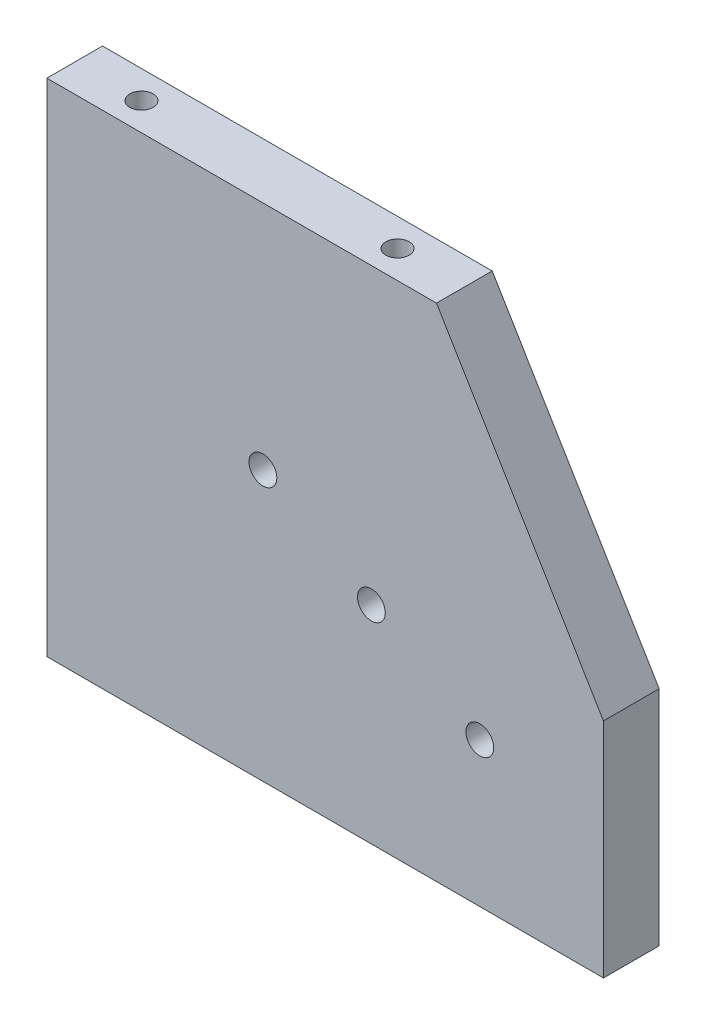
ISO-10303-21;
HEADER;
FILE_DESCRIPTION(('STEP AP214'),'2;1');
FILE_NAME('part.step','',(''),(''),'','','');
FILE_SCHEMA(('AUTOMOTIVE_DESIGN { 1 0 10303 214 1 1 1 1 }'));
ENDSEC;
DATA;
#1=APPLICATION_CONTEXT('core data for automotive mechanical design processes');
#2=APPLICATION_PROTOCOL_DEFINITION('international standard','automotive_design',2000,#1);
#3=PRODUCT_CONTEXT('',#1,'mechanical');
#4=PRODUCT('Part','Part','',(#3));
#5=PRODUCT_RELATED_PRODUCT_CATEGORY('part','',(#4));
#6=PRODUCT_DEFINITION_FORMATION('','',#4);
#7=PRODUCT_DEFINITION_CONTEXT('part definition',#1,'design');
#8=PRODUCT_DEFINITION('design','',#6,#7);
#9=PRODUCT_DEFINITION_SHAPE('','',#8);
#10=(LENGTH_UNIT() NAMED_UNIT(*) SI_UNIT(.MILLI.,.METRE.));
#11=(NAMED_UNIT(*) PLANE_ANGLE_UNIT() SI_UNIT($,.RADIAN.));
#12=(NAMED_UNIT(*) SI_UNIT($,.STERADIAN.) SOLID_ANGLE_UNIT());
#13=UNCERTAINTY_MEASURE_WITH_UNIT(LENGTH_MEASURE(1.E-05),#10,'distance_accuracy_value','');
#14=(GEOMETRIC_REPRESENTATION_CONTEXT(3) GLOBAL_UNCERTAINTY_ASSIGNED_CONTEXT((#13)) GLOBAL_UNIT_ASSIGNED_CONTEXT((#10,
#11,#12)) REPRESENTATION_CONTEXT('',''));
#15=CARTESIAN_POINT('',(0.,0.,0.));
#16=DIRECTION('',(0.,0.,1.));
#17=DIRECTION('',(1.,0.,0.));
#18=AXIS2_PLACEMENT_3D('',#15,#16,#17);
#19=CARTESIAN_POINT('',(-30.3157894736842,32.6842105263158,10.));
#20=DIRECTION('',(1.,0.,0.));
#21=DIRECTION('',(0.,0.,-1.));
#22=AXIS2_PLACEMENT_3D('',#19,#20,#21);
#23=PLANE('',#22);
#24=DIRECTION('',(0.,-1.,0.));
#25=VECTOR('',#24,1.);
#26=CARTESIAN_POINT('',(-30.3157894736842,32.6842105263158,0.));
#27=LINE('',#26,#25);
#28=CARTESIAN_POINT('',(-30.3157894736842,32.6842105263158,0.));
#29=VERTEX_POINT('',#28);
#30=CARTESIAN_POINT('',(-30.3157894736842,-57.3157894736842,0.));
#31=VERTEX_POINT('',#30);
#32=EDGE_CURVE('E113',#29,#31,#27,.T.);
#33=ORIENTED_EDGE('',*,*,#32,.T.);
#34=DIRECTION('',(0.,0.,-1.));
#35=VECTOR('',#34,1.);
#36=CARTESIAN_POINT('',(-30.3157894736842,-57.3157894736842,10.));
#37=LINE('',#36,#35);
#38=CARTESIAN_POINT('',(-30.3157894736842,-57.3157894736842,10.));
#39=VERTEX_POINT('',#38);
#40=EDGE_CURVE('E11',#39,#31,#37,.T.);
#41=ORIENTED_EDGE('',*,*,#40,.F.);
#42=DIRECTION('',(0.,-1.,0.));
#43=VECTOR('',#42,1.);
#44=CARTESIAN_POINT('',(-30.3157894736842,32.6842105263158,10.));
#45=LINE('',#44,#43);
#46=CARTESIAN_POINT('',(-30.3157894736842,32.6842105263158,10.));
#47=VERTEX_POINT('',#46);
#48=EDGE_CURVE('E121',#47,#39,#45,.T.);
#49=ORIENTED_EDGE('',*,*,#48,.F.);
#50=DIRECTION('',(0.,0.,-1.));
#51=VECTOR('',#50,1.);
#52=CARTESIAN_POINT('',(-30.3157894736842,32.6842105263158,10.));
#53=LINE('',#52,#51);
#54=EDGE_CURVE('E109',#47,#29,#53,.T.);
#55=ORIENTED_EDGE('',*,*,#54,.T.);
#56=EDGE_LOOP('',(#33,#41,#49,#55));
#57=FACE_BOUND('',#56,.T.);
#58=ADVANCED_FACE('F35',(#57),#23,.F.);
#59=CARTESIAN_POINT('',(-30.3157894736842,-57.3157894736842,10.));
#60=DIRECTION('',(0.,1.,0.));
#61=DIRECTION('',(0.,0.,1.));
#62=AXIS2_PLACEMENT_3D('',#59,#60,#61);
#63=PLANE('',#62);
#64=DIRECTION('',(1.,0.,0.));
#65=VECTOR('',#64,1.);
#66=CARTESIAN_POINT('',(-30.3157894736842,-57.3157894736842,0.));
#67=LINE('',#66,#65);
#68=CARTESIAN_POINT('',(69.6842105263158,-57.3157894736842,0.));
#69=VERTEX_POINT('',#68);
#70=EDGE_CURVE('E116',#31,#69,#67,.T.);
#71=ORIENTED_EDGE('',*,*,#70,.T.);
#72=DIRECTION('',(0.,0.,-1.));
#73=VECTOR('',#72,1.);
#74=CARTESIAN_POINT('',(69.6842105263158,-57.3157894736842,10.));
#75=LINE('',#74,#73);
#76=CARTESIAN_POINT('',(69.6842105263158,-57.3157894736842,10.));
#77=VERTEX_POINT('',#76);
#78=EDGE_CURVE('E44',#77,#69,#75,.T.);
#79=ORIENTED_EDGE('',*,*,#78,.F.);
#80=DIRECTION('',(1.,0.,0.));
#81=VECTOR('',#80,1.);
#82=CARTESIAN_POINT('',(-30.3157894736842,-57.3157894736842,10.));
#83=LINE('',#82,#81);
#84=EDGE_CURVE('E87',#39,#77,#83,.T.);
#85=ORIENTED_EDGE('',*,*,#84,.F.);
#86=ORIENTED_EDGE('',*,*,#40,.T.);
#87=EDGE_LOOP('',(#71,#79,#85,#86));
#88=FACE_BOUND('',#87,.T.);
#89=ADVANCED_FACE('F145',(#88),#63,.F.);
#90=CARTESIAN_POINT('',(69.6842105263158,-17.3157894736842,10.));
#91=DIRECTION('',(-1.,0.,0.));
#92=DIRECTION('',(0.,0.,1.));
#93=AXIS2_PLACEMENT_3D('',#90,#91,#92);
#94=PLANE('',#93);
#95=DIRECTION('',(0.,1.,0.));
#96=VECTOR('',#95,1.);
#97=CARTESIAN_POINT('',(69.6842105263158,-17.3157894736842,0.));
#98=LINE('',#97,#96);
#99=CARTESIAN_POINT('',(69.6842105263158,-17.3157894736842,0.));
#100=VERTEX_POINT('',#99);
#101=EDGE_CURVE('E104',#69,#100,#98,.T.);
#102=ORIENTED_EDGE('',*,*,#101,.T.);
#103=DIRECTION('',(0.,0.,-1.));
#104=VECTOR('',#103,1.);
#105=CARTESIAN_POINT('',(69.6842105263158,-17.3157894736842,10.));
#106=LINE('',#105,#104);
#107=CARTESIAN_POINT('',(69.6842105263158,-17.3157894736842,10.));
#108=VERTEX_POINT('',#107);
#109=EDGE_CURVE('E101',#108,#100,#106,.T.);
#110=ORIENTED_EDGE('',*,*,#109,.F.);
#111=DIRECTION('',(0.,1.,0.));
#112=VECTOR('',#111,1.);
#113=CARTESIAN_POINT('',(69.6842105263158,-17.3157894736842,10.));
#114=LINE('',#113,#112);
#115=EDGE_CURVE('E93',#77,#108,#114,.T.);
#116=ORIENTED_EDGE('',*,*,#115,.F.);
#117=ORIENTED_EDGE('',*,*,#78,.T.);
#118=EDGE_LOOP('',(#102,#110,#116,#117));
#119=FACE_BOUND('',#118,.T.);
#120=ADVANCED_FACE('F102',(#119),#94,.F.);
#121=CARTESIAN_POINT('',(39.6842105263158,32.6842105263158,10.));
#122=DIRECTION('',(-0.857492925712544,-0.514495755427527,0.));
#123=DIRECTION('',(0.514495755427527,-0.857492925712544,0.));
#124=AXIS2_PLACEMENT_3D('',#121,#122,#123);
#125=PLANE('',#124);
#126=DIRECTION('',(-0.514495755427527,0.857492925712544,0.));
#127=VECTOR('',#126,1.);
#128=CARTESIAN_POINT('',(39.6842105263158,32.6842105263158,0.));
#129=LINE('',#128,#127);
#130=CARTESIAN_POINT('',(39.6842105263158,32.6842105263158,0.));
#131=VERTEX_POINT('',#130);
#132=EDGE_CURVE('E73',#100,#131,#129,.T.);
#133=ORIENTED_EDGE('',*,*,#132,.T.);
#134=DIRECTION('',(0.,0.,-1.));
#135=VECTOR('',#134,1.);
#136=CARTESIAN_POINT('',(39.6842105263158,32.6842105263158,10.));
#137=LINE('',#136,#135);
#138=CARTESIAN_POINT('',(39.6842105263158,32.6842105263158,10.));
#139=VERTEX_POINT('',#138);
#140=EDGE_CURVE('E105',#139,#131,#137,.T.);
#141=ORIENTED_EDGE('',*,*,#140,.F.);
#142=DIRECTION('',(-0.514495755427527,0.857492925712544,0.));
#143=VECTOR('',#142,1.);
#144=CARTESIAN_POINT('',(39.6842105263158,32.6842105263158,10.));
#145=LINE('',#144,#143);
#146=EDGE_CURVE('E97',#108,#139,#145,.T.);
#147=ORIENTED_EDGE('',*,*,#146,.F.);
#148=ORIENTED_EDGE('',*,*,#109,.T.);
#149=EDGE_LOOP('',(#133,#141,#147,#148));
#150=FACE_BOUND('',#149,.T.);
#151=ADVANCED_FACE('F107',(#150),#125,.F.);
#152=CARTESIAN_POINT('',(-30.3157894736842,32.6842105263158,10.));
#153=DIRECTION('',(0.,-1.,0.));
#154=DIRECTION('',(1.,0.,0.));
#155=AXIS2_PLACEMENT_3D('',#152,#153,#154);
#156=PLANE('',#155);
#157=CARTESIAN_POINT('',(-18.3157894736842,32.6842105263158,5.));
#158=DIRECTION('',(0.,1.,0.));
#159=DIRECTION('',(0.,0.,1.));
#160=AXIS2_PLACEMENT_3D('',#157,#158,#159);
#161=CIRCLE('',#160,2.1);
#162=CARTESIAN_POINT('',(-18.3157894736842,32.6842105263158,7.1));
#163=VERTEX_POINT('',#162);
#164=EDGE_CURVE('E262',#163,#163,#161,.T.);
#165=ORIENTED_EDGE('',*,*,#164,.F.);
#166=EDGE_LOOP('',(#165));
#167=FACE_BOUND('',#166,.T.);
#168=CARTESIAN_POINT('',(27.6842105263158,32.6842105263158,5.));
#169=DIRECTION('',(0.,1.,0.));
#170=DIRECTION('',(0.,0.,1.));
#171=AXIS2_PLACEMENT_3D('',#168,#169,#170);
#172=CIRCLE('',#171,2.1);
#173=CARTESIAN_POINT('',(27.6842105263158,32.6842105263158,7.1));
#174=VERTEX_POINT('',#173);
#175=EDGE_CURVE('E264',#174,#174,#172,.T.);
#176=ORIENTED_EDGE('',*,*,#175,.F.);
#177=EDGE_LOOP('',(#176));
#178=FACE_BOUND('',#177,.T.);
#179=DIRECTION('',(-1.,0.,0.));
#180=VECTOR('',#179,1.);
#181=CARTESIAN_POINT('',(-30.3157894736842,32.6842105263158,0.));
#182=LINE('',#181,#180);
#183=EDGE_CURVE('E79',#131,#29,#182,.T.);
#184=ORIENTED_EDGE('',*,*,#183,.T.);
#185=ORIENTED_EDGE('',*,*,#54,.F.);
#186=DIRECTION('',(-1.,0.,0.));
#187=VECTOR('',#186,1.);
#188=CARTESIAN_POINT('',(-30.3157894736842,32.6842105263158,10.));
#189=LINE('',#188,#187);
#190=EDGE_CURVE('E52',#139,#47,#189,.T.);
#191=ORIENTED_EDGE('',*,*,#190,.F.);
#192=ORIENTED_EDGE('',*,*,#140,.T.);
#193=EDGE_LOOP('',(#184,#185,#191,#192));
#194=FACE_BOUND('',#193,.T.);
#195=ADVANCED_FACE('F130',(#167,#178,#194),#156,.F.);
#196=CARTESIAN_POINT('',(0.,0.,10.));
#197=DIRECTION('',(0.,0.,1.));
#198=DIRECTION('',(1.,0.,0.));
#199=AXIS2_PLACEMENT_3D('',#196,#197,#198);
#200=PLANE('',#199);
#201=CARTESIAN_POINT('',(8.49863894116592,-8.86578947368418,10.));
#202=DIRECTION('',(0.,0.,1.));
#203=DIRECTION('',(1.,0.,0.));
#204=AXIS2_PLACEMENT_3D('',#201,#202,#203);
#205=CIRCLE('',#204,2.5);
#206=CARTESIAN_POINT('',(10.9986389411659,-8.86578947368418,10.));
#207=VERTEX_POINT('',#206);
#208=EDGE_CURVE('E272',#207,#207,#205,.T.);
#209=ORIENTED_EDGE('',*,*,#208,.F.);
#210=EDGE_LOOP('',(#209));
#211=FACE_BOUND('',#210,.T.);
#212=CARTESIAN_POINT('',(47.4697821114657,-31.3657894736842,10.));
#213=DIRECTION('',(0.,0.,1.));
#214=DIRECTION('',(1.,0.,0.));
#215=AXIS2_PLACEMENT_3D('',#212,#213,#214);
#216=CIRCLE('',#215,2.5);
#217=CARTESIAN_POINT('',(49.9697821114657,-31.3657894736842,10.));
#218=VERTEX_POINT('',#217);
#219=EDGE_CURVE('E278',#218,#218,#216,.T.);
#220=ORIENTED_EDGE('',*,*,#219,.F.);
#221=EDGE_LOOP('',(#220));
#222=FACE_BOUND('',#221,.T.);
#223=CARTESIAN_POINT('',(27.9842105263158,-20.1157894736842,10.));
#224=DIRECTION('',(0.,0.,1.));
#225=DIRECTION('',(1.,0.,0.));
#226=AXIS2_PLACEMENT_3D('',#223,#224,#225);
#227=CIRCLE('',#226,2.5);
#228=CARTESIAN_POINT('',(30.4842105263158,-20.1157894736842,10.));
#229=VERTEX_POINT('',#228);
#230=EDGE_CURVE('E284',#229,#229,#227,.T.);
#231=ORIENTED_EDGE('',*,*,#230,.F.);
#232=EDGE_LOOP('',(#231));
#233=FACE_BOUND('',#232,.T.);
#234=ORIENTED_EDGE('',*,*,#48,.T.);
#235=ORIENTED_EDGE('',*,*,#84,.T.);
#236=ORIENTED_EDGE('',*,*,#115,.T.);
#237=ORIENTED_EDGE('',*,*,#146,.T.);
#238=ORIENTED_EDGE('',*,*,#190,.T.);
#239=EDGE_LOOP('',(#234,#235,#236,#237,#238));
#240=FACE_BOUND('',#239,.T.);
#241=ADVANCED_FACE('F95',(#211,#222,#233,#240),#200,.T.);
#242=CARTESIAN_POINT('',(0.,0.,0.));
#243=DIRECTION('',(0.,0.,1.));
#244=DIRECTION('',(1.,0.,0.));
#245=AXIS2_PLACEMENT_3D('',#242,#243,#244);
#246=PLANE('',#245);
#247=CARTESIAN_POINT('',(8.49863894116592,-8.86578947368418,0.));
#248=DIRECTION('',(0.,0.,1.));
#249=DIRECTION('',(1.,0.,0.));
#250=AXIS2_PLACEMENT_3D('',#247,#248,#249);
#251=CIRCLE('',#250,2.5);
#252=CARTESIAN_POINT('',(10.9986389411659,-8.86578947368418,0.));
#253=VERTEX_POINT('',#252);
#254=EDGE_CURVE('E275',#253,#253,#251,.T.);
#255=ORIENTED_EDGE('',*,*,#254,.T.);
#256=EDGE_LOOP('',(#255));
#257=FACE_BOUND('',#256,.T.);
#258=CARTESIAN_POINT('',(47.4697821114657,-31.3657894736842,0.));
#259=DIRECTION('',(0.,0.,1.));
#260=DIRECTION('',(1.,0.,0.));
#261=AXIS2_PLACEMENT_3D('',#258,#259,#260);
#262=CIRCLE('',#261,2.5);
#263=CARTESIAN_POINT('',(49.9697821114657,-31.3657894736842,0.));
#264=VERTEX_POINT('',#263);
#265=EDGE_CURVE('E281',#264,#264,#262,.T.);
#266=ORIENTED_EDGE('',*,*,#265,.T.);
#267=EDGE_LOOP('',(#266));
#268=FACE_BOUND('',#267,.T.);
#269=CARTESIAN_POINT('',(27.9842105263158,-20.1157894736842,0.));
#270=DIRECTION('',(0.,0.,1.));
#271=DIRECTION('',(1.,0.,0.));
#272=AXIS2_PLACEMENT_3D('',#269,#270,#271);
#273=CIRCLE('',#272,2.5);
#274=CARTESIAN_POINT('',(30.4842105263158,-20.1157894736842,0.));
#275=VERTEX_POINT('',#274);
#276=EDGE_CURVE('E38',#275,#275,#273,.T.);
#277=ORIENTED_EDGE('',*,*,#276,.T.);
#278=EDGE_LOOP('',(#277));
#279=FACE_BOUND('',#278,.T.);
#280=ORIENTED_EDGE('',*,*,#32,.F.);
#281=ORIENTED_EDGE('',*,*,#183,.F.);
#282=ORIENTED_EDGE('',*,*,#132,.F.);
#283=ORIENTED_EDGE('',*,*,#101,.F.);
#284=ORIENTED_EDGE('',*,*,#70,.F.);
#285=EDGE_LOOP('',(#280,#281,#282,#283,#284));
#286=FACE_BOUND('',#285,.T.);
#287=ADVANCED_FACE('F126',(#257,#268,#279,#286),#246,.F.);
#288=CARTESIAN_POINT('',(27.9842105263158,-20.1157894736842,10.));
#289=DIRECTION('',(0.,0.,1.));
#290=DIRECTION('',(1.,0.,0.));
#291=AXIS2_PLACEMENT_3D('',#288,#289,#290);
#292=CYLINDRICAL_SURFACE('',#291,2.5);
#293=ORIENTED_EDGE('',*,*,#230,.T.);
#294=EDGE_LOOP('',(#293));
#295=FACE_BOUND('',#294,.T.);
#296=ORIENTED_EDGE('',*,*,#276,.F.);
#297=EDGE_LOOP('',(#296));
#298=FACE_BOUND('',#297,.T.);
#299=ADVANCED_FACE('F175',(#295,#298),#292,.F.);
#300=CARTESIAN_POINT('',(47.4697821114657,-31.3657894736842,10.));
#301=DIRECTION('',(0.,0.,1.));
#302=DIRECTION('',(1.,0.,0.));
#303=AXIS2_PLACEMENT_3D('',#300,#301,#302);
#304=CYLINDRICAL_SURFACE('',#303,2.5);
#305=ORIENTED_EDGE('',*,*,#219,.T.);
#306=EDGE_LOOP('',(#305));
#307=FACE_BOUND('',#306,.T.);
#308=ORIENTED_EDGE('',*,*,#265,.F.);
#309=EDGE_LOOP('',(#308));
#310=FACE_BOUND('',#309,.T.);
#311=ADVANCED_FACE('F185',(#307,#310),#304,.F.);
#312=CARTESIAN_POINT('',(8.49863894116592,-8.86578947368418,10.));
#313=DIRECTION('',(0.,0.,1.));
#314=DIRECTION('',(1.,0.,0.));
#315=AXIS2_PLACEMENT_3D('',#312,#313,#314);
#316=CYLINDRICAL_SURFACE('',#315,2.5);
#317=ORIENTED_EDGE('',*,*,#208,.T.);
#318=EDGE_LOOP('',(#317));
#319=FACE_BOUND('',#318,.T.);
#320=ORIENTED_EDGE('',*,*,#254,.F.);
#321=EDGE_LOOP('',(#320));
#322=FACE_BOUND('',#321,.T.);
#323=ADVANCED_FACE('F197',(#319,#322),#316,.F.);
#324=CARTESIAN_POINT('',(27.6842105263158,24.6842105263158,5.));
#325=DIRECTION('',(0.,1.,0.));
#326=DIRECTION('',(0.,0.,1.));
#327=AXIS2_PLACEMENT_3D('',#324,#325,#326);
#328=CONICAL_SURFACE('',#327,2.1,1.02974425867665);
#329=CARTESIAN_POINT('',(27.6842105263158,23.4224032263579,5.));
#330=VERTEX_POINT('',#329);
#331=VERTEX_LOOP('',#330);
#332=FACE_BOUND('',#331,.T.);
#333=CARTESIAN_POINT('',(27.6842105263158,24.6842105263158,5.));
#334=DIRECTION('',(0.,1.,0.));
#335=DIRECTION('',(0.,0.,1.));
#336=AXIS2_PLACEMENT_3D('',#333,#334,#335);
#337=CIRCLE('',#336,2.1);
#338=CARTESIAN_POINT('',(27.6842105263158,24.6842105263158,7.1));
#339=VERTEX_POINT('',#338);
#340=EDGE_CURVE('E269',#339,#339,#337,.T.);
#341=ORIENTED_EDGE('',*,*,#340,.T.);
#342=EDGE_LOOP('',(#341));
#343=FACE_BOUND('',#342,.T.);
#344=ADVANCED_FACE('F207',(#332,#343),#328,.F.);
#345=CARTESIAN_POINT('',(27.6842105263158,32.6842105263158,5.));
#346=DIRECTION('',(0.,1.,0.));
#347=DIRECTION('',(0.,0.,1.));
#348=AXIS2_PLACEMENT_3D('',#345,#346,#347);
#349=CYLINDRICAL_SURFACE('',#348,2.1);
#350=ORIENTED_EDGE('',*,*,#340,.F.);
#351=EDGE_LOOP('',(#350));
#352=FACE_BOUND('',#351,.T.);
#353=ORIENTED_EDGE('',*,*,#175,.T.);
#354=EDGE_LOOP('',(#353));
#355=FACE_BOUND('',#354,.T.);
#356=ADVANCED_FACE('F221',(#352,#355),#349,.F.);
#357=CARTESIAN_POINT('',(-18.3157894736842,24.6842105263158,5.));
#358=DIRECTION('',(0.,1.,0.));
#359=DIRECTION('',(0.,0.,1.));
#360=AXIS2_PLACEMENT_3D('',#357,#358,#359);
#361=CONICAL_SURFACE('',#360,2.1,1.02974425867665);
#362=CARTESIAN_POINT('',(-18.3157894736842,23.4224032263579,5.));
#363=VERTEX_POINT('',#362);
#364=VERTEX_LOOP('',#363);
#365=FACE_BOUND('',#364,.T.);
#366=CARTESIAN_POINT('',(-18.3157894736842,24.6842105263158,5.));
#367=DIRECTION('',(0.,1.,0.));
#368=DIRECTION('',(0.,0.,1.));
#369=AXIS2_PLACEMENT_3D('',#366,#367,#368);
#370=CIRCLE('',#369,2.1);
#371=CARTESIAN_POINT('',(-18.3157894736842,24.6842105263158,7.1));
#372=VERTEX_POINT('',#371);
#373=EDGE_CURVE('E260',#372,#372,#370,.T.);
#374=ORIENTED_EDGE('',*,*,#373,.T.);
#375=EDGE_LOOP('',(#374));
#376=FACE_BOUND('',#375,.T.);
#377=ADVANCED_FACE('F232',(#365,#376),#361,.F.);
#378=CARTESIAN_POINT('',(-18.3157894736842,32.6842105263158,5.));
#379=DIRECTION('',(0.,1.,0.));
#380=DIRECTION('',(0.,0.,1.));
#381=AXIS2_PLACEMENT_3D('',#378,#379,#380);
#382=CYLINDRICAL_SURFACE('',#381,2.1);
#383=ORIENTED_EDGE('',*,*,#373,.F.);
#384=EDGE_LOOP('',(#383));
#385=FACE_BOUND('',#384,.T.);
#386=ORIENTED_EDGE('',*,*,#164,.T.);
#387=EDGE_LOOP('',(#386));
#388=FACE_BOUND('',#387,.T.);
#389=ADVANCED_FACE('F242',(#385,#388),#382,.F.);
#390=CLOSED_SHELL('',(#58,#89,#120,#151,#195,#241,#287,#299,#311,#323,#344,#356,#377,#389));
#391=MANIFOLD_SOLID_BREP('B2',#390);
#392=ADVANCED_BREP_SHAPE_REPRESENTATION('',(#18,#391),#14);
#393=SHAPE_DEFINITION_REPRESENTATION(#9,#392);
ENDSEC;
END-ISO-10303-21;
